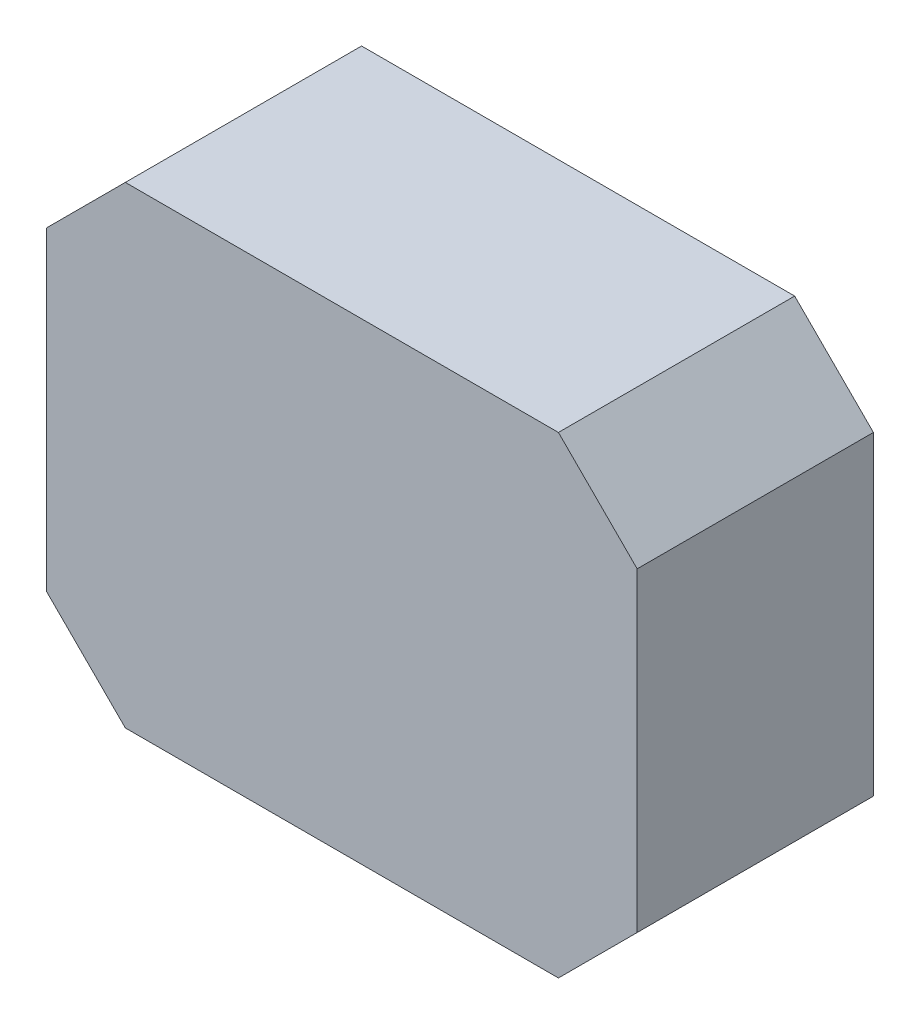
ISO-10303-21;
HEADER;
FILE_DESCRIPTION(('STEP AP214'),'2;1');
FILE_NAME('part.step','',(''),(''),'','','');
FILE_SCHEMA(('AUTOMOTIVE_DESIGN { 1 0 10303 214 1 1 1 1 }'));
ENDSEC;
DATA;
#1=APPLICATION_CONTEXT('core data for automotive mechanical design processes');
#2=APPLICATION_PROTOCOL_DEFINITION('international standard','automotive_design',2000,#1);
#3=PRODUCT_CONTEXT('',#1,'mechanical');
#4=PRODUCT('Part','Part','',(#3));
#5=PRODUCT_RELATED_PRODUCT_CATEGORY('part','',(#4));
#6=PRODUCT_DEFINITION_FORMATION('','',#4);
#7=PRODUCT_DEFINITION_CONTEXT('part definition',#1,'design');
#8=PRODUCT_DEFINITION('design','',#6,#7);
#9=PRODUCT_DEFINITION_SHAPE('','',#8);
#10=(LENGTH_UNIT() NAMED_UNIT(*) SI_UNIT(.MILLI.,.METRE.));
#11=(NAMED_UNIT(*) PLANE_ANGLE_UNIT() SI_UNIT($,.RADIAN.));
#12=(NAMED_UNIT(*) SI_UNIT($,.STERADIAN.) SOLID_ANGLE_UNIT());
#13=UNCERTAINTY_MEASURE_WITH_UNIT(LENGTH_MEASURE(1.E-05),#10,'distance_accuracy_value','');
#14=(GEOMETRIC_REPRESENTATION_CONTEXT(3) GLOBAL_UNCERTAINTY_ASSIGNED_CONTEXT((#13)) GLOBAL_UNIT_ASSIGNED_CONTEXT((#10,
#11,#12)) REPRESENTATION_CONTEXT('',''));
#15=CARTESIAN_POINT('',(0.,0.,0.));
#16=DIRECTION('',(0.,0.,1.));
#17=DIRECTION('',(1.,0.,0.));
#18=AXIS2_PLACEMENT_3D('',#15,#16,#17);
#19=CARTESIAN_POINT('',(0.,0.,30.));
#20=DIRECTION('',(1.,0.,0.));
#21=DIRECTION('',(0.,1.,0.));
#22=AXIS2_PLACEMENT_3D('',#19,#20,#21);
#23=PLANE('',#22);
#24=DIRECTION('',(0.,-1.,0.));
#25=VECTOR('',#24,1.);
#26=CARTESIAN_POINT('',(0.,0.,-30.));
#27=LINE('',#26,#25);
#28=CARTESIAN_POINT('',(0.,100.,-30.));
#29=VERTEX_POINT('',#28);
#30=CARTESIAN_POINT('',(0.,20.0000000000001,-30.));
#31=VERTEX_POINT('',#30);
#32=EDGE_CURVE('E143',#29,#31,#27,.T.);
#33=ORIENTED_EDGE('',*,*,#32,.T.);
#34=DIRECTION('',(0.,0.,1.));
#35=VECTOR('',#34,1.);
#36=CARTESIAN_POINT('',(0.,20.0000000000001,30.));
#37=LINE('',#36,#35);
#38=CARTESIAN_POINT('',(0.,20.0000000000001,30.));
#39=VERTEX_POINT('',#38);
#40=EDGE_CURVE('E165',#31,#39,#37,.T.);
#41=ORIENTED_EDGE('',*,*,#40,.T.);
#42=DIRECTION('',(0.,-1.,0.));
#43=VECTOR('',#42,1.);
#44=CARTESIAN_POINT('',(0.,0.,30.));
#45=LINE('',#44,#43);
#46=CARTESIAN_POINT('',(0.,100.,30.));
#47=VERTEX_POINT('',#46);
#48=EDGE_CURVE('E141',#47,#39,#45,.T.);
#49=ORIENTED_EDGE('',*,*,#48,.F.);
#50=DIRECTION('',(0.,0.,-1.));
#51=VECTOR('',#50,1.);
#52=CARTESIAN_POINT('',(0.,100.,30.));
#53=LINE('',#52,#51);
#54=EDGE_CURVE('E162',#47,#29,#53,.T.);
#55=ORIENTED_EDGE('',*,*,#54,.T.);
#56=EDGE_LOOP('',(#33,#41,#49,#55));
#57=FACE_BOUND('',#56,.T.);
#58=ADVANCED_FACE('F45',(#57),#23,.F.);
#59=CARTESIAN_POINT('',(0.,0.,30.));
#60=DIRECTION('',(0.,1.,0.));
#61=DIRECTION('',(0.,0.,1.));
#62=AXIS2_PLACEMENT_3D('',#59,#60,#61);
#63=PLANE('',#62);
#64=DIRECTION('',(1.,0.,0.));
#65=VECTOR('',#64,1.);
#66=CARTESIAN_POINT('',(0.,0.,-30.));
#67=LINE('',#66,#65);
#68=CARTESIAN_POINT('',(20.,0.,-30.));
#69=VERTEX_POINT('',#68);
#70=CARTESIAN_POINT('',(130.,0.,-30.));
#71=VERTEX_POINT('',#70);
#72=EDGE_CURVE('E139',#69,#71,#67,.T.);
#73=ORIENTED_EDGE('',*,*,#72,.T.);
#74=DIRECTION('',(0.,0.,1.));
#75=VECTOR('',#74,1.);
#76=CARTESIAN_POINT('',(130.,0.,30.));
#77=LINE('',#76,#75);
#78=CARTESIAN_POINT('',(130.,0.,30.));
#79=VERTEX_POINT('',#78);
#80=EDGE_CURVE('E117',#71,#79,#77,.T.);
#81=ORIENTED_EDGE('',*,*,#80,.T.);
#82=DIRECTION('',(1.,0.,0.));
#83=VECTOR('',#82,1.);
#84=CARTESIAN_POINT('',(0.,0.,30.));
#85=LINE('',#84,#83);
#86=CARTESIAN_POINT('',(20.,0.,30.));
#87=VERTEX_POINT('',#86);
#88=EDGE_CURVE('E179',#87,#79,#85,.T.);
#89=ORIENTED_EDGE('',*,*,#88,.F.);
#90=DIRECTION('',(0.,0.,-1.));
#91=VECTOR('',#90,1.);
#92=CARTESIAN_POINT('',(20.,0.,30.));
#93=LINE('',#92,#91);
#94=EDGE_CURVE('E122',#87,#69,#93,.T.);
#95=ORIENTED_EDGE('',*,*,#94,.T.);
#96=EDGE_LOOP('',(#73,#81,#89,#95));
#97=FACE_BOUND('',#96,.T.);
#98=ADVANCED_FACE('F184',(#97),#63,.F.);
#99=CARTESIAN_POINT('',(150.,0.,30.));
#100=DIRECTION('',(-1.,0.,0.));
#101=DIRECTION('',(0.,-1.,0.));
#102=AXIS2_PLACEMENT_3D('',#99,#100,#101);
#103=PLANE('',#102);
#104=DIRECTION('',(0.,1.,0.));
#105=VECTOR('',#104,1.);
#106=CARTESIAN_POINT('',(150.,0.,30.));
#107=LINE('',#106,#105);
#108=CARTESIAN_POINT('',(150.,20.,30.));
#109=VERTEX_POINT('',#108);
#110=CARTESIAN_POINT('',(150.,99.9999999999999,30.));
#111=VERTEX_POINT('',#110);
#112=EDGE_CURVE('E131',#109,#111,#107,.T.);
#113=ORIENTED_EDGE('',*,*,#112,.F.);
#114=DIRECTION('',(0.,0.,-1.));
#115=VECTOR('',#114,1.);
#116=CARTESIAN_POINT('',(150.,20.,30.));
#117=LINE('',#116,#115);
#118=CARTESIAN_POINT('',(150.,20.,-30.));
#119=VERTEX_POINT('',#118);
#120=EDGE_CURVE('E116',#109,#119,#117,.T.);
#121=ORIENTED_EDGE('',*,*,#120,.T.);
#122=DIRECTION('',(0.,1.,0.));
#123=VECTOR('',#122,1.);
#124=CARTESIAN_POINT('',(150.,0.,-30.));
#125=LINE('',#124,#123);
#126=CARTESIAN_POINT('',(150.,99.9999999999999,-30.));
#127=VERTEX_POINT('',#126);
#128=EDGE_CURVE('E129',#119,#127,#125,.T.);
#129=ORIENTED_EDGE('',*,*,#128,.T.);
#130=DIRECTION('',(0.,0.,1.));
#131=VECTOR('',#130,1.);
#132=CARTESIAN_POINT('',(150.,99.9999999999999,30.));
#133=LINE('',#132,#131);
#134=EDGE_CURVE('E133',#127,#111,#133,.T.);
#135=ORIENTED_EDGE('',*,*,#134,.T.);
#136=EDGE_LOOP('',(#113,#121,#129,#135));
#137=FACE_BOUND('',#136,.T.);
#138=ADVANCED_FACE('F128',(#137),#103,.F.);
#139=CARTESIAN_POINT('',(0.,120.,30.));
#140=DIRECTION('',(0.,-1.,0.));
#141=DIRECTION('',(0.,0.,-1.));
#142=AXIS2_PLACEMENT_3D('',#139,#140,#141);
#143=PLANE('',#142);
#144=DIRECTION('',(-1.,0.,0.));
#145=VECTOR('',#144,1.);
#146=CARTESIAN_POINT('',(0.,120.,30.));
#147=LINE('',#146,#145);
#148=CARTESIAN_POINT('',(130.,120.,30.));
#149=VERTEX_POINT('',#148);
#150=CARTESIAN_POINT('',(20.,120.,30.));
#151=VERTEX_POINT('',#150);
#152=EDGE_CURVE('E147',#149,#151,#147,.T.);
#153=ORIENTED_EDGE('',*,*,#152,.F.);
#154=DIRECTION('',(0.,0.,-1.));
#155=VECTOR('',#154,1.);
#156=CARTESIAN_POINT('',(130.,120.,30.));
#157=LINE('',#156,#155);
#158=CARTESIAN_POINT('',(130.,120.,-30.));
#159=VERTEX_POINT('',#158);
#160=EDGE_CURVE('E11',#149,#159,#157,.T.);
#161=ORIENTED_EDGE('',*,*,#160,.T.);
#162=DIRECTION('',(-1.,0.,0.));
#163=VECTOR('',#162,1.);
#164=CARTESIAN_POINT('',(0.,120.,-30.));
#165=LINE('',#164,#163);
#166=CARTESIAN_POINT('',(20.,120.,-30.));
#167=VERTEX_POINT('',#166);
#168=EDGE_CURVE('E138',#159,#167,#165,.T.);
#169=ORIENTED_EDGE('',*,*,#168,.T.);
#170=DIRECTION('',(0.,0.,1.));
#171=VECTOR('',#170,1.);
#172=CARTESIAN_POINT('',(20.,120.,30.));
#173=LINE('',#172,#171);
#174=EDGE_CURVE('E54',#167,#151,#173,.T.);
#175=ORIENTED_EDGE('',*,*,#174,.T.);
#176=EDGE_LOOP('',(#153,#161,#169,#175));
#177=FACE_BOUND('',#176,.T.);
#178=ADVANCED_FACE('F191',(#177),#143,.F.);
#179=CARTESIAN_POINT('',(0.,0.,30.));
#180=DIRECTION('',(0.,0.,-1.));
#181=DIRECTION('',(-1.,0.,0.));
#182=AXIS2_PLACEMENT_3D('',#179,#180,#181);
#183=PLANE('',#182);
#184=ORIENTED_EDGE('',*,*,#88,.T.);
#185=DIRECTION('',(-0.707106781186549,-0.707106781186547,0.));
#186=VECTOR('',#185,1.);
#187=CARTESIAN_POINT('',(150.,20.,30.));
#188=LINE('',#187,#186);
#189=EDGE_CURVE('E160',#79,#109,#188,.F.);
#190=ORIENTED_EDGE('',*,*,#189,.T.);
#191=ORIENTED_EDGE('',*,*,#112,.T.);
#192=DIRECTION('',(0.707106781186546,-0.707106781186549,0.));
#193=VECTOR('',#192,1.);
#194=CARTESIAN_POINT('',(130.,120.,30.));
#195=LINE('',#194,#193);
#196=EDGE_CURVE('E67',#111,#149,#195,.F.);
#197=ORIENTED_EDGE('',*,*,#196,.T.);
#198=ORIENTED_EDGE('',*,*,#152,.T.);
#199=DIRECTION('',(0.707106781186548,0.707106781186547,0.));
#200=VECTOR('',#199,1.);
#201=CARTESIAN_POINT('',(0.,100.,30.));
#202=LINE('',#201,#200);
#203=EDGE_CURVE('E155',#151,#47,#202,.F.);
#204=ORIENTED_EDGE('',*,*,#203,.T.);
#205=ORIENTED_EDGE('',*,*,#48,.T.);
#206=DIRECTION('',(-0.707106781186546,0.707106781186549,0.));
#207=VECTOR('',#206,1.);
#208=CARTESIAN_POINT('',(20.,0.,30.));
#209=LINE('',#208,#207);
#210=EDGE_CURVE('E158',#39,#87,#209,.F.);
#211=ORIENTED_EDGE('',*,*,#210,.T.);
#212=EDGE_LOOP('',(#184,#190,#191,#197,#198,#204,#205,#211));
#213=FACE_BOUND('',#212,.T.);
#214=ADVANCED_FACE('F176',(#213),#183,.F.);
#215=CARTESIAN_POINT('',(0.,0.,-30.));
#216=DIRECTION('',(0.,0.,-1.));
#217=DIRECTION('',(-1.,0.,0.));
#218=AXIS2_PLACEMENT_3D('',#215,#216,#217);
#219=PLANE('',#218);
#220=ORIENTED_EDGE('',*,*,#128,.F.);
#221=DIRECTION('',(0.707106781186549,0.707106781186547,0.));
#222=VECTOR('',#221,1.);
#223=CARTESIAN_POINT('',(64.9999999999998,-65.,-30.));
#224=LINE('',#223,#222);
#225=EDGE_CURVE('E112',#119,#71,#224,.F.);
#226=ORIENTED_EDGE('',*,*,#225,.T.);
#227=ORIENTED_EDGE('',*,*,#72,.F.);
#228=DIRECTION('',(0.707106781186546,-0.707106781186549,0.));
#229=VECTOR('',#228,1.);
#230=CARTESIAN_POINT('',(10.,9.99999999999999,-30.));
#231=LINE('',#230,#229);
#232=EDGE_CURVE('E123',#69,#31,#231,.F.);
#233=ORIENTED_EDGE('',*,*,#232,.T.);
#234=ORIENTED_EDGE('',*,*,#32,.F.);
#235=DIRECTION('',(-0.707106781186548,-0.707106781186547,0.));
#236=VECTOR('',#235,1.);
#237=CARTESIAN_POINT('',(-50.,50.0000000000001,-30.));
#238=LINE('',#237,#236);
#239=EDGE_CURVE('E132',#29,#167,#238,.F.);
#240=ORIENTED_EDGE('',*,*,#239,.T.);
#241=ORIENTED_EDGE('',*,*,#168,.F.);
#242=DIRECTION('',(-0.707106781186546,0.707106781186549,0.));
#243=VECTOR('',#242,1.);
#244=CARTESIAN_POINT('',(125.,125.,-30.));
#245=LINE('',#244,#243);
#246=EDGE_CURVE('E137',#159,#127,#245,.F.);
#247=ORIENTED_EDGE('',*,*,#246,.T.);
#248=EDGE_LOOP('',(#220,#226,#227,#233,#234,#240,#241,#247));
#249=FACE_BOUND('',#248,.T.);
#250=ADVANCED_FACE('F135',(#249),#219,.T.);
#251=CARTESIAN_POINT('',(150.,20.,30.));
#252=DIRECTION('',(-0.707106781186547,0.707106781186549,0.));
#253=DIRECTION('',(0.,0.,-1.));
#254=AXIS2_PLACEMENT_3D('',#251,#252,#253);
#255=PLANE('',#254);
#256=ORIENTED_EDGE('',*,*,#189,.F.);
#257=ORIENTED_EDGE('',*,*,#80,.F.);
#258=ORIENTED_EDGE('',*,*,#225,.F.);
#259=ORIENTED_EDGE('',*,*,#120,.F.);
#260=EDGE_LOOP('',(#256,#257,#258,#259));
#261=FACE_BOUND('',#260,.T.);
#262=ADVANCED_FACE('F115',(#261),#255,.F.);
#263=CARTESIAN_POINT('',(20.,0.,30.));
#264=DIRECTION('',(0.707106781186549,0.707106781186546,0.));
#265=DIRECTION('',(0.,0.,-1.));
#266=AXIS2_PLACEMENT_3D('',#263,#264,#265);
#267=PLANE('',#266);
#268=ORIENTED_EDGE('',*,*,#210,.F.);
#269=ORIENTED_EDGE('',*,*,#40,.F.);
#270=ORIENTED_EDGE('',*,*,#232,.F.);
#271=ORIENTED_EDGE('',*,*,#94,.F.);
#272=EDGE_LOOP('',(#268,#269,#270,#271));
#273=FACE_BOUND('',#272,.T.);
#274=ADVANCED_FACE('F182',(#273),#267,.F.);
#275=CARTESIAN_POINT('',(130.,120.,30.));
#276=DIRECTION('',(-0.707106781186549,-0.707106781186546,0.));
#277=DIRECTION('',(0.,0.,-1.));
#278=AXIS2_PLACEMENT_3D('',#275,#276,#277);
#279=PLANE('',#278);
#280=ORIENTED_EDGE('',*,*,#196,.F.);
#281=ORIENTED_EDGE('',*,*,#134,.F.);
#282=ORIENTED_EDGE('',*,*,#246,.F.);
#283=ORIENTED_EDGE('',*,*,#160,.F.);
#284=EDGE_LOOP('',(#280,#281,#282,#283));
#285=FACE_BOUND('',#284,.T.);
#286=ADVANCED_FACE('F190',(#285),#279,.F.);
#287=CARTESIAN_POINT('',(0.,100.,30.));
#288=DIRECTION('',(0.707106781186547,-0.707106781186548,0.));
#289=DIRECTION('',(0.,0.,-1.));
#290=AXIS2_PLACEMENT_3D('',#287,#288,#289);
#291=PLANE('',#290);
#292=ORIENTED_EDGE('',*,*,#203,.F.);
#293=ORIENTED_EDGE('',*,*,#174,.F.);
#294=ORIENTED_EDGE('',*,*,#239,.F.);
#295=ORIENTED_EDGE('',*,*,#54,.F.);
#296=EDGE_LOOP('',(#292,#293,#294,#295));
#297=FACE_BOUND('',#296,.T.);
#298=ADVANCED_FACE('F48',(#297),#291,.F.);
#299=CLOSED_SHELL('',(#58,#98,#138,#178,#214,#250,#262,#274,#286,#298));
#300=MANIFOLD_SOLID_BREP('B2',#299);
#301=ADVANCED_BREP_SHAPE_REPRESENTATION('',(#18,#300),#14);
#302=SHAPE_DEFINITION_REPRESENTATION(#9,#301);
ENDSEC;
END-ISO-10303-21;
